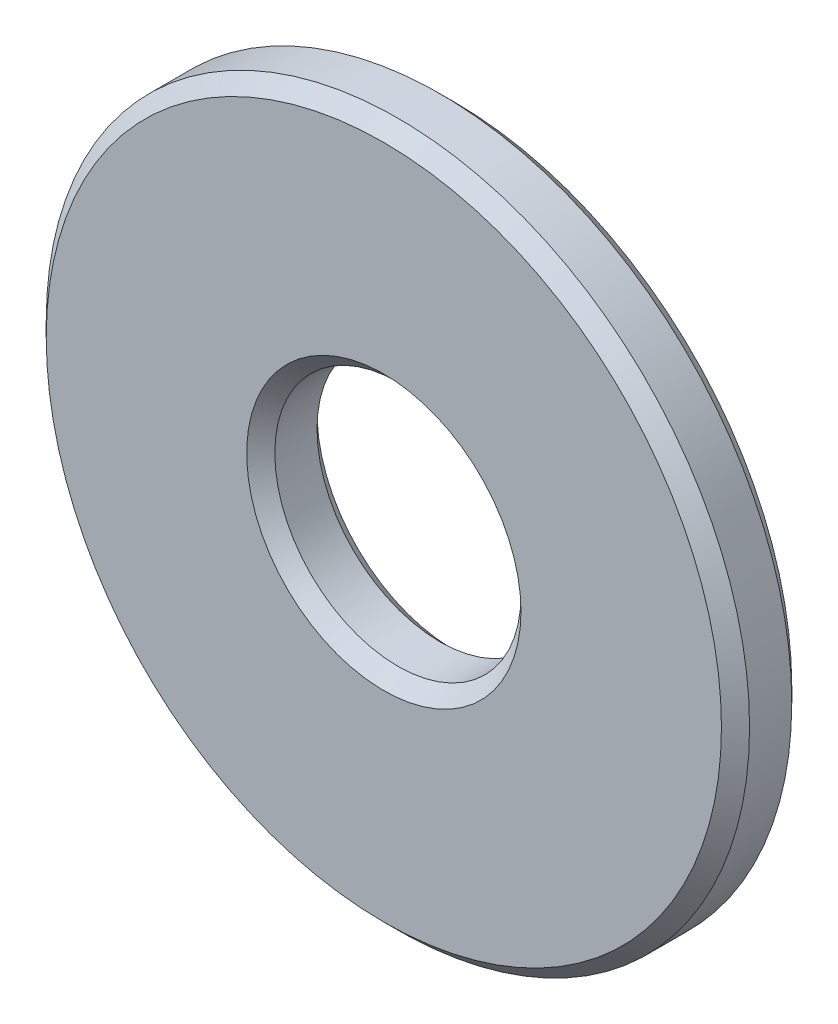
ISO-10303-21;
HEADER;
FILE_DESCRIPTION(('STEP AP214'),'2;1');
FILE_NAME('part.step','',(''),(''),'','','');
FILE_SCHEMA(('AUTOMOTIVE_DESIGN { 1 0 10303 214 1 1 1 1 }'));
ENDSEC;
DATA;
#1=APPLICATION_CONTEXT('core data for automotive mechanical design processes');
#2=APPLICATION_PROTOCOL_DEFINITION('international standard','automotive_design',2000,#1);
#3=PRODUCT_CONTEXT('',#1,'mechanical');
#4=PRODUCT('Part','Part','',(#3));
#5=PRODUCT_RELATED_PRODUCT_CATEGORY('part','',(#4));
#6=PRODUCT_DEFINITION_FORMATION('','',#4);
#7=PRODUCT_DEFINITION_CONTEXT('part definition',#1,'design');
#8=PRODUCT_DEFINITION('design','',#6,#7);
#9=PRODUCT_DEFINITION_SHAPE('','',#8);
#10=(LENGTH_UNIT() NAMED_UNIT(*) SI_UNIT(.MILLI.,.METRE.));
#11=(NAMED_UNIT(*) PLANE_ANGLE_UNIT() SI_UNIT($,.RADIAN.));
#12=(NAMED_UNIT(*) SI_UNIT($,.STERADIAN.) SOLID_ANGLE_UNIT());
#13=UNCERTAINTY_MEASURE_WITH_UNIT(LENGTH_MEASURE(1.E-05),#10,'distance_accuracy_value','');
#14=(GEOMETRIC_REPRESENTATION_CONTEXT(3) GLOBAL_UNCERTAINTY_ASSIGNED_CONTEXT((#13)) GLOBAL_UNIT_ASSIGNED_CONTEXT((#10,
#11,#12)) REPRESENTATION_CONTEXT('',''));
#15=CARTESIAN_POINT('',(0.,0.,0.));
#16=DIRECTION('',(0.,0.,1.));
#17=DIRECTION('',(1.,0.,0.));
#18=AXIS2_PLACEMENT_3D('',#15,#16,#17);
#19=CARTESIAN_POINT('',(0.,0.,1.));
#20=DIRECTION('',(0.,0.,1.));
#21=DIRECTION('',(1.,0.,0.));
#22=AXIS2_PLACEMENT_3D('',#19,#20,#21);
#23=PLANE('',#22);
#24=CARTESIAN_POINT('',(0.,0.,1.));
#25=DIRECTION('',(0.,0.,1.));
#26=DIRECTION('',(1.,0.,0.));
#27=AXIS2_PLACEMENT_3D('',#24,#25,#26);
#28=CIRCLE('',#27,1.95);
#29=CARTESIAN_POINT('',(1.95,0.,1.));
#30=VERTEX_POINT('',#29);
#31=EDGE_CURVE('E10',#30,#30,#28,.F.);
#32=ORIENTED_EDGE('',*,*,#31,.T.);
#33=EDGE_LOOP('',(#32));
#34=FACE_BOUND('',#33,.T.);
#35=CARTESIAN_POINT('',(0.,0.,1.));
#36=DIRECTION('',(0.,0.,1.));
#37=DIRECTION('',(1.,0.,0.));
#38=AXIS2_PLACEMENT_3D('',#35,#36,#37);
#39=CIRCLE('',#38,4.8);
#40=CARTESIAN_POINT('',(4.8,0.,1.));
#41=VERTEX_POINT('',#40);
#42=EDGE_CURVE('E38',#41,#41,#39,.T.);
#43=ORIENTED_EDGE('',*,*,#42,.T.);
#44=EDGE_LOOP('',(#43));
#45=FACE_BOUND('',#44,.T.);
#46=ADVANCED_FACE('F31',(#34,#45),#23,.T.);
#47=CARTESIAN_POINT('',(0.,0.,0.));
#48=DIRECTION('',(0.,0.,1.));
#49=DIRECTION('',(1.,0.,0.));
#50=AXIS2_PLACEMENT_3D('',#47,#48,#49);
#51=PLANE('',#50);
#52=CARTESIAN_POINT('',(0.,0.,0.));
#53=DIRECTION('',(0.,0.,1.));
#54=DIRECTION('',(1.,0.,0.));
#55=AXIS2_PLACEMENT_3D('',#52,#53,#54);
#56=CIRCLE('',#55,1.95);
#57=CARTESIAN_POINT('',(1.95,0.,0.));
#58=VERTEX_POINT('',#57);
#59=EDGE_CURVE('E57',#58,#58,#56,.T.);
#60=ORIENTED_EDGE('',*,*,#59,.T.);
#61=EDGE_LOOP('',(#60));
#62=FACE_BOUND('',#61,.T.);
#63=CARTESIAN_POINT('',(0.,0.,0.));
#64=DIRECTION('',(0.,0.,1.));
#65=DIRECTION('',(1.,0.,0.));
#66=AXIS2_PLACEMENT_3D('',#63,#64,#65);
#67=CIRCLE('',#66,4.8);
#68=CARTESIAN_POINT('',(4.8,0.,0.));
#69=VERTEX_POINT('',#68);
#70=EDGE_CURVE('E60',#69,#69,#67,.F.);
#71=ORIENTED_EDGE('',*,*,#70,.T.);
#72=EDGE_LOOP('',(#71));
#73=FACE_BOUND('',#72,.T.);
#74=ADVANCED_FACE('F64',(#62,#73),#51,.F.);
#75=CARTESIAN_POINT('',(0.,0.,1.));
#76=DIRECTION('',(0.,0.,-1.));
#77=DIRECTION('',(-1.,0.,0.));
#78=AXIS2_PLACEMENT_3D('',#75,#76,#77);
#79=CYLINDRICAL_SURFACE('',#78,5.);
#80=CARTESIAN_POINT('',(0.,0.,0.2));
#81=DIRECTION('',(0.,0.,1.));
#82=DIRECTION('',(1.,0.,0.));
#83=AXIS2_PLACEMENT_3D('',#80,#81,#82);
#84=CIRCLE('',#83,5.);
#85=CARTESIAN_POINT('',(5.,0.,0.2));
#86=VERTEX_POINT('',#85);
#87=EDGE_CURVE('E42',#86,#86,#84,.T.);
#88=ORIENTED_EDGE('',*,*,#87,.T.);
#89=EDGE_LOOP('',(#88));
#90=FACE_BOUND('',#89,.T.);
#91=CARTESIAN_POINT('',(0.,0.,0.800000000000001));
#92=DIRECTION('',(0.,0.,1.));
#93=DIRECTION('',(1.,0.,0.));
#94=AXIS2_PLACEMENT_3D('',#91,#92,#93);
#95=CIRCLE('',#94,5.);
#96=CARTESIAN_POINT('',(5.,0.,0.800000000000001));
#97=VERTEX_POINT('',#96);
#98=EDGE_CURVE('E46',#97,#97,#95,.F.);
#99=ORIENTED_EDGE('',*,*,#98,.T.);
#100=EDGE_LOOP('',(#99));
#101=FACE_BOUND('',#100,.T.);
#102=ADVANCED_FACE('F74',(#90,#101),#79,.T.);
#103=CARTESIAN_POINT('',(0.,0.,1.));
#104=DIRECTION('',(0.,0.,-1.));
#105=DIRECTION('',(-1.,0.,0.));
#106=AXIS2_PLACEMENT_3D('',#103,#104,#105);
#107=CYLINDRICAL_SURFACE('',#106,1.75);
#108=CARTESIAN_POINT('',(0.,0.,0.200000000000002));
#109=DIRECTION('',(0.,0.,1.));
#110=DIRECTION('',(1.,0.,0.));
#111=AXIS2_PLACEMENT_3D('',#108,#109,#110);
#112=CIRCLE('',#111,1.75);
#113=CARTESIAN_POINT('',(1.75,0.,0.200000000000002));
#114=VERTEX_POINT('',#113);
#115=EDGE_CURVE('E51',#114,#114,#112,.F.);
#116=ORIENTED_EDGE('',*,*,#115,.T.);
#117=EDGE_LOOP('',(#116));
#118=FACE_BOUND('',#117,.T.);
#119=CARTESIAN_POINT('',(0.,0.,0.800000000000003));
#120=DIRECTION('',(0.,0.,1.));
#121=DIRECTION('',(1.,0.,0.));
#122=AXIS2_PLACEMENT_3D('',#119,#120,#121);
#123=CIRCLE('',#122,1.75);
#124=CARTESIAN_POINT('',(1.75,0.,0.800000000000003));
#125=VERTEX_POINT('',#124);
#126=EDGE_CURVE('E54',#125,#125,#123,.T.);
#127=ORIENTED_EDGE('',*,*,#126,.T.);
#128=EDGE_LOOP('',(#127));
#129=FACE_BOUND('',#128,.T.);
#130=ADVANCED_FACE('F77',(#118,#129),#107,.F.);
#131=CARTESIAN_POINT('',(0.,0.,0.));
#132=DIRECTION('',(0.,0.,-1.));
#133=DIRECTION('',(-1.,0.,0.));
#134=AXIS2_PLACEMENT_3D('',#131,#132,#133);
#135=CONICAL_SURFACE('',#134,1.95,0.785398163397445);
#136=ORIENTED_EDGE('',*,*,#115,.F.);
#137=EDGE_LOOP('',(#136));
#138=FACE_BOUND('',#137,.T.);
#139=ORIENTED_EDGE('',*,*,#59,.F.);
#140=EDGE_LOOP('',(#139));
#141=FACE_BOUND('',#140,.T.);
#142=ADVANCED_FACE('F70',(#138,#141),#135,.F.);
#143=CARTESIAN_POINT('',(0.,0.,0.2));
#144=DIRECTION('',(0.,0.,1.));
#145=DIRECTION('',(1.,0.,0.));
#146=AXIS2_PLACEMENT_3D('',#143,#144,#145);
#147=CONICAL_SURFACE('',#146,5.,0.78539816339745);
#148=ORIENTED_EDGE('',*,*,#70,.F.);
#149=EDGE_LOOP('',(#148));
#150=FACE_BOUND('',#149,.T.);
#151=ORIENTED_EDGE('',*,*,#87,.F.);
#152=EDGE_LOOP('',(#151));
#153=FACE_BOUND('',#152,.T.);
#154=ADVANCED_FACE('F66',(#150,#153),#147,.T.);
#155=CARTESIAN_POINT('',(0.,0.,0.800000000000003));
#156=DIRECTION('',(0.,0.,1.));
#157=DIRECTION('',(1.,0.,0.));
#158=AXIS2_PLACEMENT_3D('',#155,#156,#157);
#159=CONICAL_SURFACE('',#158,1.75,0.785398163397452);
#160=ORIENTED_EDGE('',*,*,#31,.F.);
#161=EDGE_LOOP('',(#160));
#162=FACE_BOUND('',#161,.T.);
#163=ORIENTED_EDGE('',*,*,#126,.F.);
#164=EDGE_LOOP('',(#163));
#165=FACE_BOUND('',#164,.T.);
#166=ADVANCED_FACE('F69',(#162,#165),#159,.F.);
#167=CARTESIAN_POINT('',(0.,0.,1.));
#168=DIRECTION('',(0.,0.,-1.));
#169=DIRECTION('',(-1.,0.,0.));
#170=AXIS2_PLACEMENT_3D('',#167,#168,#169);
#171=CONICAL_SURFACE('',#170,4.8,0.785398163397446);
#172=ORIENTED_EDGE('',*,*,#98,.F.);
#173=EDGE_LOOP('',(#172));
#174=FACE_BOUND('',#173,.T.);
#175=ORIENTED_EDGE('',*,*,#42,.F.);
#176=EDGE_LOOP('',(#175));
#177=FACE_BOUND('',#176,.T.);
#178=ADVANCED_FACE('F33',(#174,#177),#171,.T.);
#179=CLOSED_SHELL('',(#46,#74,#102,#130,#142,#154,#166,#178));
#180=MANIFOLD_SOLID_BREP('B2',#179);
#181=ADVANCED_BREP_SHAPE_REPRESENTATION('',(#18,#180),#14);
#182=SHAPE_DEFINITION_REPRESENTATION(#9,#181);
ENDSEC;
END-ISO-10303-21;
